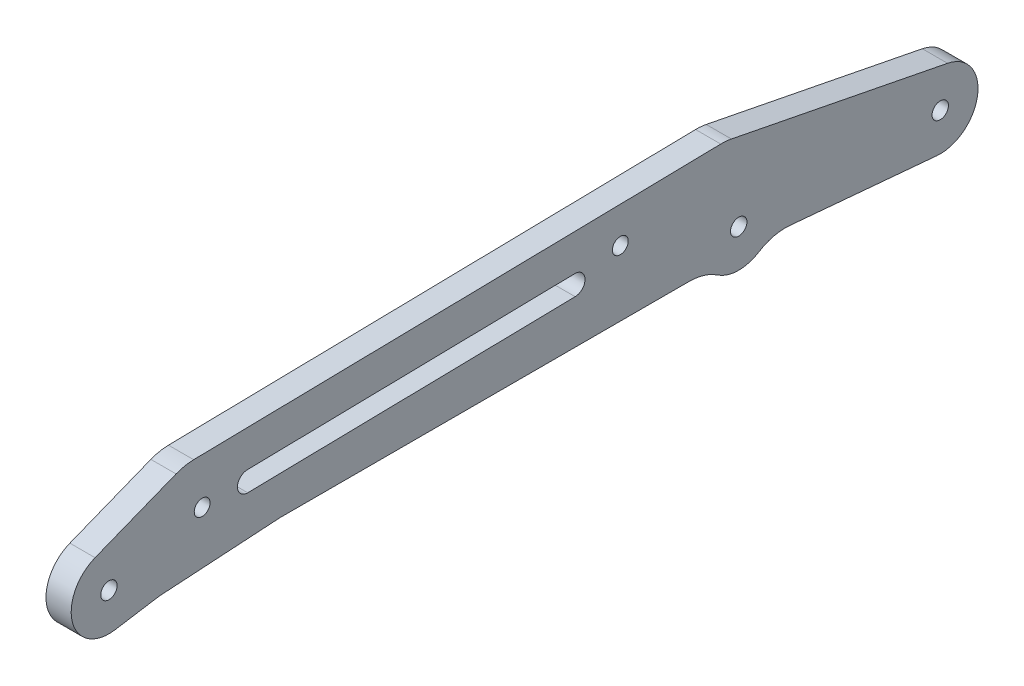
ISO-10303-21;
HEADER;
FILE_DESCRIPTION(('STEP AP214'),'2;1');
FILE_NAME('part.step','',(''),(''),'','','');
FILE_SCHEMA(('AUTOMOTIVE_DESIGN { 1 0 10303 214 1 1 1 1 }'));
ENDSEC;
DATA;
#1=APPLICATION_CONTEXT('core data for automotive mechanical design processes');
#2=APPLICATION_PROTOCOL_DEFINITION('international standard','automotive_design',2000,#1);
#3=PRODUCT_CONTEXT('',#1,'mechanical');
#4=PRODUCT('Part','Part','',(#3));
#5=PRODUCT_RELATED_PRODUCT_CATEGORY('part','',(#4));
#6=PRODUCT_DEFINITION_FORMATION('','',#4);
#7=PRODUCT_DEFINITION_CONTEXT('part definition',#1,'design');
#8=PRODUCT_DEFINITION('design','',#6,#7);
#9=PRODUCT_DEFINITION_SHAPE('','',#8);
#10=(LENGTH_UNIT() NAMED_UNIT(*) SI_UNIT(.MILLI.,.METRE.));
#11=(NAMED_UNIT(*) PLANE_ANGLE_UNIT() SI_UNIT($,.RADIAN.));
#12=(NAMED_UNIT(*) SI_UNIT($,.STERADIAN.) SOLID_ANGLE_UNIT());
#13=UNCERTAINTY_MEASURE_WITH_UNIT(LENGTH_MEASURE(1.E-05),#10,'distance_accuracy_value','');
#14=(GEOMETRIC_REPRESENTATION_CONTEXT(3) GLOBAL_UNCERTAINTY_ASSIGNED_CONTEXT((#13)) GLOBAL_UNIT_ASSIGNED_CONTEXT((#10,
#11,#12)) REPRESENTATION_CONTEXT('',''));
#15=CARTESIAN_POINT('',(0.,0.,0.));
#16=DIRECTION('',(0.,0.,1.));
#17=DIRECTION('',(1.,0.,0.));
#18=AXIS2_PLACEMENT_3D('',#15,#16,#17);
#19=CARTESIAN_POINT('',(2.5,-15.9506465412037,113.898149240446));
#20=DIRECTION('',(-1.,0.,0.));
#21=DIRECTION('',(0.,0.,1.));
#22=AXIS2_PLACEMENT_3D('',#19,#20,#21);
#23=CYLINDRICAL_SURFACE('',#22,9.99999999999999);
#24=DIRECTION('',(1.,0.,0.));
#25=VECTOR('',#24,1.);
#26=CARTESIAN_POINT('',(2.5,-6.07543657815531,115.473023262617));
#27=LINE('',#26,#25);
#28=CARTESIAN_POINT('',(-2.5,-6.0754365781553,115.473023262617));
#29=VERTEX_POINT('',#28);
#30=CARTESIAN_POINT('',(2.5,-6.07543657815531,115.473023262617));
#31=VERTEX_POINT('',#30);
#32=EDGE_CURVE('E167',#29,#31,#27,.T.);
#33=ORIENTED_EDGE('',*,*,#32,.F.);
#34=CARTESIAN_POINT('',(-2.5,-15.9506465412037,113.898149240446));
#35=DIRECTION('',(-1.,0.,0.));
#36=DIRECTION('',(0.,0.,1.));
#37=AXIS2_PLACEMENT_3D('',#34,#35,#36);
#38=CIRCLE('',#37,9.99999999999999);
#39=CARTESIAN_POINT('',(-2.5,-5.97012075637485,114.521932101997));
#40=VERTEX_POINT('',#39);
#41=EDGE_CURVE('E20',#40,#29,#38,.F.);
#42=ORIENTED_EDGE('',*,*,#41,.F.);
#43=DIRECTION('',(1.,0.,0.));
#44=VECTOR('',#43,1.);
#45=CARTESIAN_POINT('',(2.5,-5.97012075637486,114.521932101997));
#46=LINE('',#45,#44);
#47=CARTESIAN_POINT('',(2.5,-5.97012075637485,114.521932101997));
#48=VERTEX_POINT('',#47);
#49=EDGE_CURVE('E239',#40,#48,#46,.T.);
#50=ORIENTED_EDGE('',*,*,#49,.T.);
#51=CARTESIAN_POINT('',(2.5,-15.9506465412037,113.898149240446));
#52=DIRECTION('',(-1.,0.,0.));
#53=DIRECTION('',(0.,0.,1.));
#54=AXIS2_PLACEMENT_3D('',#51,#52,#53);
#55=CIRCLE('',#54,9.99999999999999);
#56=EDGE_CURVE('E168',#31,#48,#55,.T.);
#57=ORIENTED_EDGE('',*,*,#56,.F.);
#58=EDGE_LOOP('',(#33,#42,#50,#57));
#59=FACE_BOUND('',#58,.T.);
#60=ADVANCED_FACE('F17',(#59),#23,.F.);
#61=CARTESIAN_POINT('',(2.5,-14.5,90.687804581186));
#62=DIRECTION('',(1.,0.,0.));
#63=DIRECTION('',(0.,0.,-1.));
#64=AXIS2_PLACEMENT_3D('',#61,#62,#63);
#65=CYLINDRICAL_SURFACE('',#64,9.99999999999999);
#66=DIRECTION('',(1.,0.,0.));
#67=VECTOR('',#66,1.);
#68=CARTESIAN_POINT('',(2.5,-4.51947421517113,91.3115874427379));
#69=LINE('',#68,#67);
#70=CARTESIAN_POINT('',(2.5,-4.51947421517113,91.3115874427379));
#71=VERTEX_POINT('',#70);
#72=CARTESIAN_POINT('',(-2.5,-4.51947421517113,91.3115874427379));
#73=VERTEX_POINT('',#72);
#74=EDGE_CURVE('E238',#71,#73,#69,.F.);
#75=ORIENTED_EDGE('',*,*,#74,.T.);
#76=CARTESIAN_POINT('',(-2.5,-14.5,90.687804581186));
#77=DIRECTION('',(1.,0.,0.));
#78=DIRECTION('',(0.,0.,-1.));
#79=AXIS2_PLACEMENT_3D('',#76,#77,#78);
#80=CIRCLE('',#79,9.99999999999999);
#81=CARTESIAN_POINT('',(-2.5,-4.50000000000001,90.687804581186));
#82=VERTEX_POINT('',#81);
#83=EDGE_CURVE('E165',#82,#73,#80,.T.);
#84=ORIENTED_EDGE('',*,*,#83,.F.);
#85=DIRECTION('',(1.,0.,0.));
#86=VECTOR('',#85,1.);
#87=CARTESIAN_POINT('',(2.5,-4.50000000000001,90.687804581186));
#88=LINE('',#87,#86);
#89=CARTESIAN_POINT('',(2.5,-4.50000000000001,90.687804581186));
#90=VERTEX_POINT('',#89);
#91=EDGE_CURVE('E235',#82,#90,#88,.T.);
#92=ORIENTED_EDGE('',*,*,#91,.T.);
#93=CARTESIAN_POINT('',(2.5,-14.5,90.687804581186));
#94=DIRECTION('',(1.,0.,0.));
#95=DIRECTION('',(0.,0.,-1.));
#96=AXIS2_PLACEMENT_3D('',#93,#94,#95);
#97=CIRCLE('',#96,9.99999999999999);
#98=EDGE_CURVE('E323',#71,#90,#97,.F.);
#99=ORIENTED_EDGE('',*,*,#98,.F.);
#100=EDGE_LOOP('',(#75,#84,#92,#99));
#101=FACE_BOUND('',#100,.T.);
#102=ADVANCED_FACE('F331',(#101),#65,.F.);
#103=CARTESIAN_POINT('',(2.5,0.,0.));
#104=DIRECTION('',(1.,0.,0.));
#105=DIRECTION('',(0.,0.,-1.));
#106=AXIS2_PLACEMENT_3D('',#103,#104,#105);
#107=PLANE('',#106);
#108=CARTESIAN_POINT('',(2.5,0.,125.));
#109=DIRECTION('',(-1.,0.,0.));
#110=DIRECTION('',(0.,0.,1.));
#111=AXIS2_PLACEMENT_3D('',#108,#109,#110);
#112=CIRCLE('',#111,1.62500000000002);
#113=CARTESIAN_POINT('',(2.5,0.,126.625));
#114=VERTEX_POINT('',#113);
#115=EDGE_CURVE('E299',#114,#114,#112,.T.);
#116=ORIENTED_EDGE('',*,*,#115,.T.);
#117=EDGE_LOOP('',(#116));
#118=FACE_BOUND('',#117,.T.);
#119=CARTESIAN_POINT('',(2.5,0.,0.));
#120=DIRECTION('',(-1.,0.,0.));
#121=DIRECTION('',(0.,0.,1.));
#122=AXIS2_PLACEMENT_3D('',#119,#120,#121);
#123=CIRCLE('',#122,1.625);
#124=CARTESIAN_POINT('',(2.5,0.,1.625));
#125=VERTEX_POINT('',#124);
#126=EDGE_CURVE('E192',#125,#125,#123,.T.);
#127=ORIENTED_EDGE('',*,*,#126,.T.);
#128=EDGE_LOOP('',(#127));
#129=FACE_BOUND('',#128,.T.);
#130=CARTESIAN_POINT('',(2.5,4.98106203042247,97.4943767977606));
#131=DIRECTION('',(-1.,0.,0.));
#132=DIRECTION('',(0.,0.,1.));
#133=AXIS2_PLACEMENT_3D('',#130,#131,#132);
#134=CIRCLE('',#133,2.);
#135=CARTESIAN_POINT('',(2.5,2.98140807363721,97.4571739334483));
#136=VERTEX_POINT('',#135);
#137=CARTESIAN_POINT('',(2.5,6.98071598720774,97.5315796620728));
#138=VERTEX_POINT('',#137);
#139=EDGE_CURVE('E199',#136,#138,#134,.T.);
#140=ORIENTED_EDGE('',*,*,#139,.T.);
#141=DIRECTION('',(0.,-0.0186014321561424,0.999826978392632));
#142=VECTOR('',#141,1.);
#143=CARTESIAN_POINT('',(2.5,8.79221372846742,0.163576069366839));
#144=LINE('',#143,#142);
#145=CARTESIAN_POINT('',(2.5,8.18980907735699,32.5428260665517));
#146=VERTEX_POINT('',#145);
#147=EDGE_CURVE('E195',#138,#146,#144,.F.);
#148=ORIENTED_EDGE('',*,*,#147,.T.);
#149=CARTESIAN_POINT('',(2.5,6.19015512057173,32.5056232022395));
#150=DIRECTION('',(-1.,0.,0.));
#151=DIRECTION('',(0.,0.,1.));
#152=AXIS2_PLACEMENT_3D('',#149,#150,#151);
#153=CIRCLE('',#152,2.);
#154=CARTESIAN_POINT('',(2.5,4.19050116378646,32.4684203379272));
#155=VERTEX_POINT('',#154);
#156=EDGE_CURVE('E193',#146,#155,#153,.T.);
#157=ORIENTED_EDGE('',*,*,#156,.T.);
#158=DIRECTION('',(0.,-0.0186014321561424,0.999826978392632));
#159=VECTOR('',#158,1.);
#160=CARTESIAN_POINT('',(2.5,4.79290581489689,0.0891703407422695));
#161=LINE('',#160,#159);
#162=EDGE_CURVE('E203',#136,#155,#161,.F.);
#163=ORIENTED_EDGE('',*,*,#162,.F.);
#164=EDGE_LOOP('',(#140,#148,#157,#163));
#165=FACE_BOUND('',#164,.T.);
#166=CARTESIAN_POINT('',(2.5,4.99999999999999,106.5));
#167=DIRECTION('',(-1.,0.,0.));
#168=DIRECTION('',(0.,0.,1.));
#169=AXIS2_PLACEMENT_3D('',#166,#167,#168);
#170=CIRCLE('',#169,1.57499999999999);
#171=CARTESIAN_POINT('',(2.5,4.99999999999999,108.075));
#172=VERTEX_POINT('',#171);
#173=EDGE_CURVE('E251',#172,#172,#170,.T.);
#174=ORIENTED_EDGE('',*,*,#173,.T.);
#175=EDGE_LOOP('',(#174));
#176=FACE_BOUND('',#175,.T.);
#177=CARTESIAN_POINT('',(2.5,8.5,23.5));
#178=DIRECTION('',(-1.,0.,0.));
#179=DIRECTION('',(0.,0.,1.));
#180=AXIS2_PLACEMENT_3D('',#177,#178,#179);
#181=CIRCLE('',#180,1.575);
#182=CARTESIAN_POINT('',(2.5,8.5,25.075));
#183=VERTEX_POINT('',#182);
#184=EDGE_CURVE('E210',#183,#183,#181,.T.);
#185=ORIENTED_EDGE('',*,*,#184,.T.);
#186=EDGE_LOOP('',(#185));
#187=FACE_BOUND('',#186,.T.);
#188=DIRECTION('',(0.,-0.0887576580011616,-0.99605325065789));
#189=VECTOR('',#188,1.);
#190=CARTESIAN_POINT('',(2.5,-3.93410522902064,0.350565560854665));
#191=LINE('',#190,#189);
#192=CARTESIAN_POINT('',(2.5,-7.47039937993417,-39.3343175649913));
#193=VERTEX_POINT('',#192);
#194=CARTESIAN_POINT('',(2.5,-4.87198454255356,-10.174472616212));
#195=VERTEX_POINT('',#194);
#196=EDGE_CURVE('E222',#193,#195,#191,.F.);
#197=ORIENTED_EDGE('',*,*,#196,.F.);
#198=CARTESIAN_POINT('',(2.5,0.,-40.));
#199=DIRECTION('',(-1.,0.,0.));
#200=DIRECTION('',(0.,0.,1.));
#201=AXIS2_PLACEMENT_3D('',#198,#199,#200);
#202=CIRCLE('',#201,7.5);
#203=CARTESIAN_POINT('',(2.5,7.35909794826338,-41.4469545216992));
#204=VERTEX_POINT('',#203);
#205=EDGE_CURVE('E219',#204,#193,#202,.T.);
#206=ORIENTED_EDGE('',*,*,#205,.F.);
#207=DIRECTION('',(0.,0.192927269559888,0.981213059768451));
#208=VECTOR('',#207,1.);
#209=CARTESIAN_POINT('',(2.5,14.9312082073686,-2.9357917752925));
#210=LINE('',#209,#208);
#211=CARTESIAN_POINT('',(2.5,15.7939988386428,1.45229414528999));
#212=VERTEX_POINT('',#211);
#213=EDGE_CURVE('E216',#212,#204,#210,.F.);
#214=ORIENTED_EDGE('',*,*,#213,.F.);
#215=CARTESIAN_POINT('',(2.5,5.98186824095833,3.38156684088887));
#216=DIRECTION('',(-1.,0.,0.));
#217=DIRECTION('',(0.,0.,1.));
#218=AXIS2_PLACEMENT_3D('',#215,#216,#217);
#219=CIRCLE('',#218,10.);
#220=CARTESIAN_POINT('',(2.5,15.9801380248846,3.56758116245029));
#221=VERTEX_POINT('',#220);
#222=EDGE_CURVE('E213',#221,#212,#219,.T.);
#223=ORIENTED_EDGE('',*,*,#222,.F.);
#224=DIRECTION('',(0.,-0.0186014321561421,0.999826978392632));
#225=VECTOR('',#224,1.);
#226=CARTESIAN_POINT('',(2.5,16.040959321814,0.298436452498867));
#227=LINE('',#226,#225);
#228=CARTESIAN_POINT('',(2.5,14.0336689941836,108.190291562629));
#229=VERTEX_POINT('',#228);
#230=EDGE_CURVE('E207',#229,#221,#227,.F.);
#231=ORIENTED_EDGE('',*,*,#230,.F.);
#232=CARTESIAN_POINT('',(2.5,4.03539921025731,108.004277241067));
#233=DIRECTION('',(-1.,0.,0.));
#234=DIRECTION('',(0.,0.,1.));
#235=AXIS2_PLACEMENT_3D('',#232,#233,#234);
#236=CIRCLE('',#235,9.99999999999999);
#237=CARTESIAN_POINT('',(2.5,13.3341269732446,111.683089819856));
#238=VERTEX_POINT('',#237);
#239=EDGE_CURVE('E260',#238,#229,#236,.T.);
#240=ORIENTED_EDGE('',*,*,#239,.F.);
#241=DIRECTION('',(0.,-0.367881257878812,0.929872776298727));
#242=VECTOR('',#241,1.);
#243=CARTESIAN_POINT('',(2.5,49.7343916487453,19.6761869214032));
#244=LINE('',#243,#242);
#245=CARTESIAN_POINT('',(2.5,6.97404582224044,127.759109434091));
#246=VERTEX_POINT('',#245);
#247=EDGE_CURVE('E249',#246,#238,#244,.F.);
#248=ORIENTED_EDGE('',*,*,#247,.F.);
#249=CARTESIAN_POINT('',(2.5,0.,125.));
#250=DIRECTION('',(-1.,0.,0.));
#251=DIRECTION('',(0.,0.,1.));
#252=AXIS2_PLACEMENT_3D('',#249,#250,#251);
#253=CIRCLE('',#252,7.50000000000001);
#254=CARTESIAN_POINT('',(2.5,-7.40640747228635,123.818844483372));
#255=VERTEX_POINT('',#254);
#256=EDGE_CURVE('E172',#255,#246,#253,.T.);
#257=ORIENTED_EDGE('',*,*,#256,.F.);
#258=DIRECTION('',(0.,0.157487402217094,-0.987520996304844));
#259=VECTOR('',#258,1.);
#260=CARTESIAN_POINT('',(2.5,12.0338570705745,1.91912971550789));
#261=LINE('',#260,#259);
#262=EDGE_CURVE('E171',#31,#255,#261,.F.);
#263=ORIENTED_EDGE('',*,*,#262,.F.);
#264=ORIENTED_EDGE('',*,*,#56,.T.);
#265=DIRECTION('',(0.,-0.0623782861551807,0.998052578482889));
#266=VECTOR('',#265,1.);
#267=CARTESIAN_POINT('',(2.5,1.18287937743191,0.0739299610894947));
#268=LINE('',#267,#266);
#269=EDGE_CURVE('E241',#48,#71,#268,.F.);
#270=ORIENTED_EDGE('',*,*,#269,.T.);
#271=ORIENTED_EDGE('',*,*,#98,.T.);
#272=DIRECTION('',(0.,0.,1.));
#273=VECTOR('',#272,1.);
#274=CARTESIAN_POINT('',(2.5,-4.50000000000001,0.));
#275=LINE('',#274,#273);
#276=CARTESIAN_POINT('',(2.5,-4.50000000000001,9.7979589711327));
#277=VERTEX_POINT('',#276);
#278=EDGE_CURVE('E234',#90,#277,#275,.F.);
#279=ORIENTED_EDGE('',*,*,#278,.T.);
#280=CARTESIAN_POINT('',(2.5,-14.5,9.7979589711327));
#281=DIRECTION('',(-1.,0.,0.));
#282=DIRECTION('',(0.,0.,1.));
#283=AXIS2_PLACEMENT_3D('',#280,#281,#282);
#284=CIRCLE('',#283,10.);
#285=CARTESIAN_POINT('',(2.5,-6.21428571428572,4.19912527334258));
#286=VERTEX_POINT('',#285);
#287=EDGE_CURVE('E233',#277,#286,#284,.T.);
#288=ORIENTED_EDGE('',*,*,#287,.T.);
#289=CARTESIAN_POINT('',(2.5,0.,0.));
#290=DIRECTION('',(-1.,0.,0.));
#291=DIRECTION('',(0.,0.,1.));
#292=AXIS2_PLACEMENT_3D('',#289,#290,#291);
#293=CIRCLE('',#292,7.5);
#294=CARTESIAN_POINT('',(2.5,-6.35679302105677,-3.98009830122875));
#295=VERTEX_POINT('',#294);
#296=EDGE_CURVE('E229',#295,#286,#293,.T.);
#297=ORIENTED_EDGE('',*,*,#296,.F.);
#298=CARTESIAN_POINT('',(2.5,-14.8325170491325,-9.28689603620041));
#299=DIRECTION('',(-1.,0.,0.));
#300=DIRECTION('',(0.,0.,1.));
#301=AXIS2_PLACEMENT_3D('',#298,#299,#300);
#302=CIRCLE('',#301,10.);
#303=EDGE_CURVE('E226',#295,#195,#302,.T.);
#304=ORIENTED_EDGE('',*,*,#303,.T.);
#305=EDGE_LOOP('',(#197,#206,#214,#223,#231,#240,#248,#257,#263,#264,#270,#271,#279,#288,#297,#304));
#306=FACE_BOUND('',#305,.T.);
#307=CARTESIAN_POINT('',(2.5,0.,-40.));
#308=DIRECTION('',(-1.,0.,0.));
#309=DIRECTION('',(0.,0.,1.));
#310=AXIS2_PLACEMENT_3D('',#307,#308,#309);
#311=CIRCLE('',#310,1.625);
#312=CARTESIAN_POINT('',(2.5,0.,-38.375));
#313=VERTEX_POINT('',#312);
#314=EDGE_CURVE('E320',#313,#313,#311,.T.);
#315=ORIENTED_EDGE('',*,*,#314,.T.);
#316=EDGE_LOOP('',(#315));
#317=FACE_BOUND('',#316,.T.);
#318=ADVANCED_FACE('F337',(#118,#129,#165,#176,#187,#306,#317),#107,.T.);
#319=CARTESIAN_POINT('',(2.5,0.,-40.));
#320=DIRECTION('',(-1.,0.,0.));
#321=DIRECTION('',(0.,0.,1.));
#322=AXIS2_PLACEMENT_3D('',#319,#320,#321);
#323=CYLINDRICAL_SURFACE('',#322,1.625);
#324=CARTESIAN_POINT('',(-2.5,0.,-40.));
#325=DIRECTION('',(-1.,0.,0.));
#326=DIRECTION('',(0.,0.,1.));
#327=AXIS2_PLACEMENT_3D('',#324,#325,#326);
#328=CIRCLE('',#327,1.625);
#329=CARTESIAN_POINT('',(-2.5,0.,-38.375));
#330=VERTEX_POINT('',#329);
#331=EDGE_CURVE('E296',#330,#330,#328,.T.);
#332=ORIENTED_EDGE('',*,*,#331,.T.);
#333=EDGE_LOOP('',(#332));
#334=FACE_BOUND('',#333,.T.);
#335=ORIENTED_EDGE('',*,*,#314,.F.);
#336=EDGE_LOOP('',(#335));
#337=FACE_BOUND('',#336,.T.);
#338=ADVANCED_FACE('F594',(#334,#337),#323,.F.);
#339=CARTESIAN_POINT('',(2.5,4.03539921025731,108.004277241067));
#340=DIRECTION('',(-1.,0.,0.));
#341=DIRECTION('',(0.,0.,1.));
#342=AXIS2_PLACEMENT_3D('',#339,#340,#341);
#343=CYLINDRICAL_SURFACE('',#342,9.99999999999999);
#344=CARTESIAN_POINT('',(-2.5,4.03539921025731,108.004277241067));
#345=DIRECTION('',(-1.,0.,0.));
#346=DIRECTION('',(0.,0.,1.));
#347=AXIS2_PLACEMENT_3D('',#344,#345,#346);
#348=CIRCLE('',#347,9.99999999999999);
#349=CARTESIAN_POINT('',(-2.5,14.0336689941836,108.190291562629));
#350=VERTEX_POINT('',#349);
#351=CARTESIAN_POINT('',(-2.5,13.3341269732446,111.683089819856));
#352=VERTEX_POINT('',#351);
#353=EDGE_CURVE('E188',#350,#352,#348,.F.);
#354=ORIENTED_EDGE('',*,*,#353,.T.);
#355=DIRECTION('',(1.,0.,0.));
#356=VECTOR('',#355,1.);
#357=CARTESIAN_POINT('',(2.5,13.3341269732446,111.683089819856));
#358=LINE('',#357,#356);
#359=EDGE_CURVE('E247',#238,#352,#358,.F.);
#360=ORIENTED_EDGE('',*,*,#359,.F.);
#361=ORIENTED_EDGE('',*,*,#239,.T.);
#362=DIRECTION('',(1.,0.,0.));
#363=VECTOR('',#362,1.);
#364=CARTESIAN_POINT('',(2.5,14.0336689941836,108.190291562629));
#365=LINE('',#364,#363);
#366=EDGE_CURVE('E206',#350,#229,#365,.T.);
#367=ORIENTED_EDGE('',*,*,#366,.F.);
#368=EDGE_LOOP('',(#354,#360,#361,#367));
#369=FACE_BOUND('',#368,.T.);
#370=ADVANCED_FACE('F351',(#369),#343,.T.);
#371=CARTESIAN_POINT('',(2.5,49.7343916487453,19.6761869214032));
#372=DIRECTION('',(0.,0.929872776298727,0.367881257878812));
#373=DIRECTION('',(0.,-0.367881257878812,0.929872776298727));
#374=AXIS2_PLACEMENT_3D('',#371,#372,#373);
#375=PLANE('',#374);
#376=DIRECTION('',(0.,-0.367881257878812,0.929872776298727));
#377=VECTOR('',#376,1.);
#378=CARTESIAN_POINT('',(-2.5,13.3341269732446,111.683089819856));
#379=LINE('',#378,#377);
#380=CARTESIAN_POINT('',(-2.5,6.97404582224044,127.759109434091));
#381=VERTEX_POINT('',#380);
#382=EDGE_CURVE('E182',#352,#381,#379,.T.);
#383=ORIENTED_EDGE('',*,*,#382,.T.);
#384=DIRECTION('',(-1.,0.,0.));
#385=VECTOR('',#384,1.);
#386=CARTESIAN_POINT('',(2.5,6.97404582224044,127.759109434091));
#387=LINE('',#386,#385);
#388=EDGE_CURVE('E245',#246,#381,#387,.T.);
#389=ORIENTED_EDGE('',*,*,#388,.F.);
#390=ORIENTED_EDGE('',*,*,#247,.T.);
#391=ORIENTED_EDGE('',*,*,#359,.T.);
#392=EDGE_LOOP('',(#383,#389,#390,#391));
#393=FACE_BOUND('',#392,.T.);
#394=ADVANCED_FACE('F348',(#393),#375,.T.);
#395=CARTESIAN_POINT('',(2.5,0.,125.));
#396=DIRECTION('',(-1.,0.,0.));
#397=DIRECTION('',(0.,0.,1.));
#398=AXIS2_PLACEMENT_3D('',#395,#396,#397);
#399=CYLINDRICAL_SURFACE('',#398,7.50000000000001);
#400=CARTESIAN_POINT('',(-2.5,0.,125.));
#401=DIRECTION('',(-1.,0.,0.));
#402=DIRECTION('',(0.,0.,1.));
#403=AXIS2_PLACEMENT_3D('',#400,#401,#402);
#404=CIRCLE('',#403,7.50000000000001);
#405=CARTESIAN_POINT('',(-2.5,-7.40640747228635,123.818844483372));
#406=VERTEX_POINT('',#405);
#407=EDGE_CURVE('E178',#381,#406,#404,.F.);
#408=ORIENTED_EDGE('',*,*,#407,.T.);
#409=DIRECTION('',(1.,0.,0.));
#410=VECTOR('',#409,1.);
#411=CARTESIAN_POINT('',(2.5,-7.40640747228636,123.818844483372));
#412=LINE('',#411,#410);
#413=EDGE_CURVE('E177',#255,#406,#412,.F.);
#414=ORIENTED_EDGE('',*,*,#413,.F.);
#415=ORIENTED_EDGE('',*,*,#256,.T.);
#416=ORIENTED_EDGE('',*,*,#388,.T.);
#417=EDGE_LOOP('',(#408,#414,#415,#416));
#418=FACE_BOUND('',#417,.T.);
#419=ADVANCED_FACE('F345',(#418),#399,.T.);
#420=CARTESIAN_POINT('',(2.5,12.0338570705745,1.91912971550789));
#421=DIRECTION('',(0.,-0.987520996304844,-0.157487402217094));
#422=DIRECTION('',(0.,0.157487402217094,-0.987520996304844));
#423=AXIS2_PLACEMENT_3D('',#420,#421,#422);
#424=PLANE('',#423);
#425=ORIENTED_EDGE('',*,*,#262,.T.);
#426=ORIENTED_EDGE('',*,*,#413,.T.);
#427=DIRECTION('',(0.,0.157487402217095,-0.987520996304844));
#428=VECTOR('',#427,1.);
#429=CARTESIAN_POINT('',(-2.5,-7.40640747228635,123.818844483372));
#430=LINE('',#429,#428);
#431=EDGE_CURVE('E162',#406,#29,#430,.T.);
#432=ORIENTED_EDGE('',*,*,#431,.T.);
#433=ORIENTED_EDGE('',*,*,#32,.T.);
#434=EDGE_LOOP('',(#425,#426,#432,#433));
#435=FACE_BOUND('',#434,.T.);
#436=ADVANCED_FACE('F175',(#435),#424,.T.);
#437=CARTESIAN_POINT('',(2.5,1.18287937743191,0.0739299610894947));
#438=DIRECTION('',(0.,0.998052578482889,0.0623782861551807));
#439=DIRECTION('',(0.,-0.0623782861551807,0.998052578482889));
#440=AXIS2_PLACEMENT_3D('',#437,#438,#439);
#441=PLANE('',#440);
#442=ORIENTED_EDGE('',*,*,#74,.F.);
#443=ORIENTED_EDGE('',*,*,#269,.F.);
#444=ORIENTED_EDGE('',*,*,#49,.F.);
#445=DIRECTION('',(0.,0.0623782861551807,-0.998052578482889));
#446=VECTOR('',#445,1.);
#447=CARTESIAN_POINT('',(-2.5,-5.97012075637486,114.521932101997));
#448=LINE('',#447,#446);
#449=EDGE_CURVE('E164',#40,#73,#448,.T.);
#450=ORIENTED_EDGE('',*,*,#449,.T.);
#451=EDGE_LOOP('',(#442,#443,#444,#450));
#452=FACE_BOUND('',#451,.T.);
#453=ADVANCED_FACE('F334',(#452),#441,.F.);
#454=CARTESIAN_POINT('',(2.5,-4.50000000000001,0.));
#455=DIRECTION('',(0.,1.,0.));
#456=DIRECTION('',(0.,0.,1.));
#457=AXIS2_PLACEMENT_3D('',#454,#455,#456);
#458=PLANE('',#457);
#459=ORIENTED_EDGE('',*,*,#91,.F.);
#460=DIRECTION('',(0.,0.,-1.));
#461=VECTOR('',#460,1.);
#462=CARTESIAN_POINT('',(-2.5,-4.50000000000001,0.));
#463=LINE('',#462,#461);
#464=CARTESIAN_POINT('',(-2.5,-4.50000000000001,9.7979589711327));
#465=VERTEX_POINT('',#464);
#466=EDGE_CURVE('E180',#82,#465,#463,.T.);
#467=ORIENTED_EDGE('',*,*,#466,.T.);
#468=DIRECTION('',(-1.,0.,0.));
#469=VECTOR('',#468,1.);
#470=CARTESIAN_POINT('',(2.5,-4.50000000000001,9.7979589711327));
#471=LINE('',#470,#469);
#472=EDGE_CURVE('E230',#465,#277,#471,.F.);
#473=ORIENTED_EDGE('',*,*,#472,.T.);
#474=ORIENTED_EDGE('',*,*,#278,.F.);
#475=EDGE_LOOP('',(#459,#467,#473,#474));
#476=FACE_BOUND('',#475,.T.);
#477=ADVANCED_FACE('F375',(#476),#458,.F.);
#478=CARTESIAN_POINT('',(2.5,-14.5,9.7979589711327));
#479=DIRECTION('',(-1.,0.,0.));
#480=DIRECTION('',(0.,0.,1.));
#481=AXIS2_PLACEMENT_3D('',#478,#479,#480);
#482=CYLINDRICAL_SURFACE('',#481,10.);
#483=ORIENTED_EDGE('',*,*,#472,.F.);
#484=CARTESIAN_POINT('',(-2.5,-14.5,9.7979589711327));
#485=DIRECTION('',(-1.,0.,0.));
#486=DIRECTION('',(0.,0.,1.));
#487=AXIS2_PLACEMENT_3D('',#484,#485,#486);
#488=CIRCLE('',#487,10.);
#489=CARTESIAN_POINT('',(-2.5,-6.21428571428572,4.19912527334258));
#490=VERTEX_POINT('',#489);
#491=EDGE_CURVE('E291',#465,#490,#488,.T.);
#492=ORIENTED_EDGE('',*,*,#491,.T.);
#493=DIRECTION('',(-1.,0.,0.));
#494=VECTOR('',#493,1.);
#495=CARTESIAN_POINT('',(2.5,-6.21428571428572,4.19912527334258));
#496=LINE('',#495,#494);
#497=EDGE_CURVE('E227',#286,#490,#496,.T.);
#498=ORIENTED_EDGE('',*,*,#497,.F.);
#499=ORIENTED_EDGE('',*,*,#287,.F.);
#500=EDGE_LOOP('',(#483,#492,#498,#499));
#501=FACE_BOUND('',#500,.T.);
#502=ADVANCED_FACE('F379',(#501),#482,.F.);
#503=CARTESIAN_POINT('',(2.5,0.,0.));
#504=DIRECTION('',(-1.,0.,0.));
#505=DIRECTION('',(0.,0.,1.));
#506=AXIS2_PLACEMENT_3D('',#503,#504,#505);
#507=CYLINDRICAL_SURFACE('',#506,7.5);
#508=ORIENTED_EDGE('',*,*,#296,.T.);
#509=ORIENTED_EDGE('',*,*,#497,.T.);
#510=CARTESIAN_POINT('',(-2.5,0.,0.));
#511=DIRECTION('',(-1.,0.,0.));
#512=DIRECTION('',(0.,0.,1.));
#513=AXIS2_PLACEMENT_3D('',#510,#511,#512);
#514=CIRCLE('',#513,7.5);
#515=CARTESIAN_POINT('',(-2.5,-6.35679302105677,-3.98009830122875));
#516=VERTEX_POINT('',#515);
#517=EDGE_CURVE('E288',#490,#516,#514,.F.);
#518=ORIENTED_EDGE('',*,*,#517,.T.);
#519=DIRECTION('',(-1.,0.,0.));
#520=VECTOR('',#519,1.);
#521=CARTESIAN_POINT('',(2.5,-6.35679302105677,-3.98009830122875));
#522=LINE('',#521,#520);
#523=EDGE_CURVE('E223',#516,#295,#522,.F.);
#524=ORIENTED_EDGE('',*,*,#523,.T.);
#525=EDGE_LOOP('',(#508,#509,#518,#524));
#526=FACE_BOUND('',#525,.T.);
#527=ADVANCED_FACE('F382',(#526),#507,.T.);
#528=CARTESIAN_POINT('',(2.5,-14.8325170491325,-9.28689603620041));
#529=DIRECTION('',(-1.,0.,0.));
#530=DIRECTION('',(0.,0.,1.));
#531=AXIS2_PLACEMENT_3D('',#528,#529,#530);
#532=CYLINDRICAL_SURFACE('',#531,10.);
#533=ORIENTED_EDGE('',*,*,#523,.F.);
#534=CARTESIAN_POINT('',(-2.5,-14.8325170491325,-9.28689603620041));
#535=DIRECTION('',(-1.,0.,0.));
#536=DIRECTION('',(0.,0.,1.));
#537=AXIS2_PLACEMENT_3D('',#534,#535,#536);
#538=CIRCLE('',#537,10.);
#539=CARTESIAN_POINT('',(-2.5,-4.87198454255356,-10.174472616212));
#540=VERTEX_POINT('',#539);
#541=EDGE_CURVE('E285',#516,#540,#538,.T.);
#542=ORIENTED_EDGE('',*,*,#541,.T.);
#543=DIRECTION('',(1.,0.,0.));
#544=VECTOR('',#543,1.);
#545=CARTESIAN_POINT('',(2.5,-4.87198454255356,-10.174472616212));
#546=LINE('',#545,#544);
#547=EDGE_CURVE('E220',#195,#540,#546,.F.);
#548=ORIENTED_EDGE('',*,*,#547,.F.);
#549=ORIENTED_EDGE('',*,*,#303,.F.);
#550=EDGE_LOOP('',(#533,#542,#548,#549));
#551=FACE_BOUND('',#550,.T.);
#552=ADVANCED_FACE('F387',(#551),#532,.F.);
#553=CARTESIAN_POINT('',(2.5,-3.93410522902064,0.350565560854665));
#554=DIRECTION('',(0.,-0.99605325065789,0.0887576580011616));
#555=DIRECTION('',(0.,-0.0887576580011616,-0.99605325065789));
#556=AXIS2_PLACEMENT_3D('',#553,#554,#555);
#557=PLANE('',#556);
#558=DIRECTION('',(0.,-0.0887576580011616,-0.99605325065789));
#559=VECTOR('',#558,1.);
#560=CARTESIAN_POINT('',(-2.5,-4.87198454255356,-10.174472616212));
#561=LINE('',#560,#559);
#562=CARTESIAN_POINT('',(-2.5,-7.47039937993417,-39.3343175649913));
#563=VERTEX_POINT('',#562);
#564=EDGE_CURVE('E284',#540,#563,#561,.T.);
#565=ORIENTED_EDGE('',*,*,#564,.T.);
#566=DIRECTION('',(-1.,0.,0.));
#567=VECTOR('',#566,1.);
#568=CARTESIAN_POINT('',(2.5,-7.47039937993417,-39.3343175649913));
#569=LINE('',#568,#567);
#570=EDGE_CURVE('E217',#193,#563,#569,.T.);
#571=ORIENTED_EDGE('',*,*,#570,.F.);
#572=ORIENTED_EDGE('',*,*,#196,.T.);
#573=ORIENTED_EDGE('',*,*,#547,.T.);
#574=EDGE_LOOP('',(#565,#571,#572,#573));
#575=FACE_BOUND('',#574,.T.);
#576=ADVANCED_FACE('F391',(#575),#557,.T.);
#577=CARTESIAN_POINT('',(2.5,0.,-40.));
#578=DIRECTION('',(-1.,0.,0.));
#579=DIRECTION('',(0.,0.,1.));
#580=AXIS2_PLACEMENT_3D('',#577,#578,#579);
#581=CYLINDRICAL_SURFACE('',#580,7.5);
#582=ORIENTED_EDGE('',*,*,#205,.T.);
#583=ORIENTED_EDGE('',*,*,#570,.T.);
#584=CARTESIAN_POINT('',(-2.5,0.,-40.));
#585=DIRECTION('',(-1.,0.,0.));
#586=DIRECTION('',(0.,0.,1.));
#587=AXIS2_PLACEMENT_3D('',#584,#585,#586);
#588=CIRCLE('',#587,7.5);
#589=CARTESIAN_POINT('',(-2.5,7.35909794826338,-41.4469545216992));
#590=VERTEX_POINT('',#589);
#591=EDGE_CURVE('E281',#563,#590,#588,.F.);
#592=ORIENTED_EDGE('',*,*,#591,.T.);
#593=DIRECTION('',(1.,0.,0.));
#594=VECTOR('',#593,1.);
#595=CARTESIAN_POINT('',(2.5,7.35909794826338,-41.4469545216992));
#596=LINE('',#595,#594);
#597=EDGE_CURVE('E214',#204,#590,#596,.F.);
#598=ORIENTED_EDGE('',*,*,#597,.F.);
#599=EDGE_LOOP('',(#582,#583,#592,#598));
#600=FACE_BOUND('',#599,.T.);
#601=ADVANCED_FACE('F393',(#600),#581,.T.);
#602=CARTESIAN_POINT('',(2.5,14.9312082073686,-2.9357917752925));
#603=DIRECTION('',(0.,0.981213059768451,-0.192927269559888));
#604=DIRECTION('',(0.,0.192927269559888,0.981213059768451));
#605=AXIS2_PLACEMENT_3D('',#602,#603,#604);
#606=PLANE('',#605);
#607=ORIENTED_EDGE('',*,*,#213,.T.);
#608=ORIENTED_EDGE('',*,*,#597,.T.);
#609=DIRECTION('',(0.,0.192927269559888,0.981213059768452));
#610=VECTOR('',#609,1.);
#611=CARTESIAN_POINT('',(-2.5,7.35909794826338,-41.4469545216992));
#612=LINE('',#611,#610);
#613=CARTESIAN_POINT('',(-2.5,15.7939988386428,1.45229414529));
#614=VERTEX_POINT('',#613);
#615=EDGE_CURVE('E280',#590,#614,#612,.T.);
#616=ORIENTED_EDGE('',*,*,#615,.T.);
#617=DIRECTION('',(-1.,0.,0.));
#618=VECTOR('',#617,1.);
#619=CARTESIAN_POINT('',(2.5,15.7939988386428,1.45229414528999));
#620=LINE('',#619,#618);
#621=EDGE_CURVE('E211',#212,#614,#620,.T.);
#622=ORIENTED_EDGE('',*,*,#621,.F.);
#623=EDGE_LOOP('',(#607,#608,#616,#622));
#624=FACE_BOUND('',#623,.T.);
#625=ADVANCED_FACE('F366',(#624),#606,.T.);
#626=CARTESIAN_POINT('',(2.5,5.98186824095833,3.38156684088887));
#627=DIRECTION('',(-1.,0.,0.));
#628=DIRECTION('',(0.,0.,1.));
#629=AXIS2_PLACEMENT_3D('',#626,#627,#628);
#630=CYLINDRICAL_SURFACE('',#629,10.);
#631=CARTESIAN_POINT('',(-2.5,5.98186824095833,3.38156684088887));
#632=DIRECTION('',(-1.,0.,0.));
#633=DIRECTION('',(0.,0.,1.));
#634=AXIS2_PLACEMENT_3D('',#631,#632,#633);
#635=CIRCLE('',#634,10.);
#636=CARTESIAN_POINT('',(-2.5,15.9801380248846,3.56758116245029));
#637=VERTEX_POINT('',#636);
#638=EDGE_CURVE('E277',#614,#637,#635,.F.);
#639=ORIENTED_EDGE('',*,*,#638,.T.);
#640=DIRECTION('',(1.,0.,0.));
#641=VECTOR('',#640,1.);
#642=CARTESIAN_POINT('',(2.5,15.9801380248846,3.56758116245029));
#643=LINE('',#642,#641);
#644=EDGE_CURVE('E204',#221,#637,#643,.F.);
#645=ORIENTED_EDGE('',*,*,#644,.F.);
#646=ORIENTED_EDGE('',*,*,#222,.T.);
#647=ORIENTED_EDGE('',*,*,#621,.T.);
#648=EDGE_LOOP('',(#639,#645,#646,#647));
#649=FACE_BOUND('',#648,.T.);
#650=ADVANCED_FACE('F361',(#649),#630,.T.);
#651=CARTESIAN_POINT('',(2.5,16.040959321814,0.298436452498867));
#652=DIRECTION('',(0.,0.999826978392632,0.0186014321561421));
#653=DIRECTION('',(0.,-0.0186014321561421,0.999826978392632));
#654=AXIS2_PLACEMENT_3D('',#651,#652,#653);
#655=PLANE('',#654);
#656=DIRECTION('',(0.,-0.0186014321561421,0.999826978392632));
#657=VECTOR('',#656,1.);
#658=CARTESIAN_POINT('',(-2.5,15.9801380248846,3.56758116245029));
#659=LINE('',#658,#657);
#660=EDGE_CURVE('E276',#637,#350,#659,.T.);
#661=ORIENTED_EDGE('',*,*,#660,.T.);
#662=ORIENTED_EDGE('',*,*,#366,.T.);
#663=ORIENTED_EDGE('',*,*,#230,.T.);
#664=ORIENTED_EDGE('',*,*,#644,.T.);
#665=EDGE_LOOP('',(#661,#662,#663,#664));
#666=FACE_BOUND('',#665,.T.);
#667=ADVANCED_FACE('F441',(#666),#655,.T.);
#668=CARTESIAN_POINT('',(2.5,8.5,23.5));
#669=DIRECTION('',(-1.,0.,0.));
#670=DIRECTION('',(0.,0.,1.));
#671=AXIS2_PLACEMENT_3D('',#668,#669,#670);
#672=CYLINDRICAL_SURFACE('',#671,1.575);
#673=CARTESIAN_POINT('',(-2.5,8.5,23.5));
#674=DIRECTION('',(-1.,0.,0.));
#675=DIRECTION('',(0.,0.,1.));
#676=AXIS2_PLACEMENT_3D('',#673,#674,#675);
#677=CIRCLE('',#676,1.575);
#678=CARTESIAN_POINT('',(-2.5,8.5,25.075));
#679=VERTEX_POINT('',#678);
#680=EDGE_CURVE('E273',#679,#679,#677,.T.);
#681=ORIENTED_EDGE('',*,*,#680,.T.);
#682=EDGE_LOOP('',(#681));
#683=FACE_BOUND('',#682,.T.);
#684=ORIENTED_EDGE('',*,*,#184,.F.);
#685=EDGE_LOOP('',(#684));
#686=FACE_BOUND('',#685,.T.);
#687=ADVANCED_FACE('F437',(#683,#686),#672,.F.);
#688=CARTESIAN_POINT('',(2.5,4.99999999999999,106.5));
#689=DIRECTION('',(-1.,0.,0.));
#690=DIRECTION('',(0.,0.,1.));
#691=AXIS2_PLACEMENT_3D('',#688,#689,#690);
#692=CYLINDRICAL_SURFACE('',#691,1.57499999999999);
#693=CARTESIAN_POINT('',(-2.5,4.99999999999999,106.5));
#694=DIRECTION('',(-1.,0.,0.));
#695=DIRECTION('',(0.,0.,1.));
#696=AXIS2_PLACEMENT_3D('',#693,#694,#695);
#697=CIRCLE('',#696,1.57499999999999);
#698=CARTESIAN_POINT('',(-2.5,4.99999999999999,108.075));
#699=VERTEX_POINT('',#698);
#700=EDGE_CURVE('E270',#699,#699,#697,.T.);
#701=ORIENTED_EDGE('',*,*,#700,.T.);
#702=EDGE_LOOP('',(#701));
#703=FACE_BOUND('',#702,.T.);
#704=ORIENTED_EDGE('',*,*,#173,.F.);
#705=EDGE_LOOP('',(#704));
#706=FACE_BOUND('',#705,.T.);
#707=ADVANCED_FACE('F433',(#703,#706),#692,.F.);
#708=CARTESIAN_POINT('',(2.5,4.79290581489689,0.0891703407422695));
#709=DIRECTION('',(0.,0.999826978392632,0.0186014321561424));
#710=DIRECTION('',(0.,-0.0186014321561424,0.999826978392632));
#711=AXIS2_PLACEMENT_3D('',#708,#709,#710);
#712=PLANE('',#711);
#713=ORIENTED_EDGE('',*,*,#162,.T.);
#714=DIRECTION('',(-1.,0.,0.));
#715=VECTOR('',#714,1.);
#716=CARTESIAN_POINT('',(2.5,4.19050116378646,32.4684203379272));
#717=LINE('',#716,#715);
#718=CARTESIAN_POINT('',(-2.5,4.19050116378646,32.4684203379272));
#719=VERTEX_POINT('',#718);
#720=EDGE_CURVE('E189',#155,#719,#717,.T.);
#721=ORIENTED_EDGE('',*,*,#720,.T.);
#722=DIRECTION('',(0.,-0.0186014321561424,0.999826978392632));
#723=VECTOR('',#722,1.);
#724=CARTESIAN_POINT('',(-2.5,4.19050116378646,32.4684203379272));
#725=LINE('',#724,#723);
#726=CARTESIAN_POINT('',(-2.5,2.98140807363721,97.4571739334483));
#727=VERTEX_POINT('',#726);
#728=EDGE_CURVE('E269',#719,#727,#725,.T.);
#729=ORIENTED_EDGE('',*,*,#728,.T.);
#730=DIRECTION('',(-1.,0.,0.));
#731=VECTOR('',#730,1.);
#732=CARTESIAN_POINT('',(2.5,2.98140807363721,97.4571739334483));
#733=LINE('',#732,#731);
#734=EDGE_CURVE('E200',#727,#136,#733,.F.);
#735=ORIENTED_EDGE('',*,*,#734,.T.);
#736=EDGE_LOOP('',(#713,#721,#729,#735));
#737=FACE_BOUND('',#736,.T.);
#738=ADVANCED_FACE('F429',(#737),#712,.T.);
#739=CARTESIAN_POINT('',(2.5,4.98106203042247,97.4943767977606));
#740=DIRECTION('',(-1.,0.,0.));
#741=DIRECTION('',(0.,0.,1.));
#742=AXIS2_PLACEMENT_3D('',#739,#740,#741);
#743=CYLINDRICAL_SURFACE('',#742,2.);
#744=ORIENTED_EDGE('',*,*,#139,.F.);
#745=ORIENTED_EDGE('',*,*,#734,.F.);
#746=CARTESIAN_POINT('',(-2.5,4.98106203042247,97.4943767977606));
#747=DIRECTION('',(-1.,0.,0.));
#748=DIRECTION('',(0.,0.,1.));
#749=AXIS2_PLACEMENT_3D('',#746,#747,#748);
#750=CIRCLE('',#749,2.);
#751=CARTESIAN_POINT('',(-2.5,6.98071598720774,97.5315796620728));
#752=VERTEX_POINT('',#751);
#753=EDGE_CURVE('E267',#727,#752,#750,.T.);
#754=ORIENTED_EDGE('',*,*,#753,.T.);
#755=DIRECTION('',(1.,0.,0.));
#756=VECTOR('',#755,1.);
#757=CARTESIAN_POINT('',(2.5,6.98071598720774,97.5315796620729));
#758=LINE('',#757,#756);
#759=EDGE_CURVE('E196',#752,#138,#758,.T.);
#760=ORIENTED_EDGE('',*,*,#759,.T.);
#761=EDGE_LOOP('',(#744,#745,#754,#760));
#762=FACE_BOUND('',#761,.T.);
#763=ADVANCED_FACE('F425',(#762),#743,.F.);
#764=CARTESIAN_POINT('',(2.5,8.79221372846742,0.163576069366839));
#765=DIRECTION('',(0.,0.999826978392632,0.0186014321561424));
#766=DIRECTION('',(0.,-0.0186014321561424,0.999826978392632));
#767=AXIS2_PLACEMENT_3D('',#764,#765,#766);
#768=PLANE('',#767);
#769=DIRECTION('',(-1.,0.,0.));
#770=VECTOR('',#769,1.);
#771=CARTESIAN_POINT('',(2.5,8.18980907735699,32.5428260665517));
#772=LINE('',#771,#770);
#773=CARTESIAN_POINT('',(-2.5,8.18980907735699,32.5428260665517));
#774=VERTEX_POINT('',#773);
#775=EDGE_CURVE('E35',#774,#146,#772,.F.);
#776=ORIENTED_EDGE('',*,*,#775,.T.);
#777=ORIENTED_EDGE('',*,*,#147,.F.);
#778=ORIENTED_EDGE('',*,*,#759,.F.);
#779=DIRECTION('',(0.,0.0186014321561424,-0.999826978392632));
#780=VECTOR('',#779,1.);
#781=CARTESIAN_POINT('',(-2.5,6.98071598720774,97.5315796620728));
#782=LINE('',#781,#780);
#783=EDGE_CURVE('E266',#752,#774,#782,.T.);
#784=ORIENTED_EDGE('',*,*,#783,.T.);
#785=EDGE_LOOP('',(#776,#777,#778,#784));
#786=FACE_BOUND('',#785,.T.);
#787=ADVANCED_FACE('F422',(#786),#768,.F.);
#788=CARTESIAN_POINT('',(2.5,6.19015512057173,32.5056232022395));
#789=DIRECTION('',(-1.,0.,0.));
#790=DIRECTION('',(0.,0.,1.));
#791=AXIS2_PLACEMENT_3D('',#788,#789,#790);
#792=CYLINDRICAL_SURFACE('',#791,2.);
#793=ORIENTED_EDGE('',*,*,#720,.F.);
#794=ORIENTED_EDGE('',*,*,#156,.F.);
#795=ORIENTED_EDGE('',*,*,#775,.F.);
#796=CARTESIAN_POINT('',(-2.5,6.19015512057173,32.5056232022395));
#797=DIRECTION('',(-1.,0.,0.));
#798=DIRECTION('',(0.,0.,1.));
#799=AXIS2_PLACEMENT_3D('',#796,#797,#798);
#800=CIRCLE('',#799,2.);
#801=EDGE_CURVE('E264',#774,#719,#800,.T.);
#802=ORIENTED_EDGE('',*,*,#801,.T.);
#803=EDGE_LOOP('',(#793,#794,#795,#802));
#804=FACE_BOUND('',#803,.T.);
#805=ADVANCED_FACE('F418',(#804),#792,.F.);
#806=CARTESIAN_POINT('',(2.5,0.,0.));
#807=DIRECTION('',(-1.,0.,0.));
#808=DIRECTION('',(0.,0.,1.));
#809=AXIS2_PLACEMENT_3D('',#806,#807,#808);
#810=CYLINDRICAL_SURFACE('',#809,1.625);
#811=CARTESIAN_POINT('',(-2.5,0.,0.));
#812=DIRECTION('',(-1.,0.,0.));
#813=DIRECTION('',(0.,0.,1.));
#814=AXIS2_PLACEMENT_3D('',#811,#812,#813);
#815=CIRCLE('',#814,1.625);
#816=CARTESIAN_POINT('',(-2.5,0.,1.625));
#817=VERTEX_POINT('',#816);
#818=EDGE_CURVE('E26',#817,#817,#815,.T.);
#819=ORIENTED_EDGE('',*,*,#818,.T.);
#820=EDGE_LOOP('',(#819));
#821=FACE_BOUND('',#820,.T.);
#822=ORIENTED_EDGE('',*,*,#126,.F.);
#823=EDGE_LOOP('',(#822));
#824=FACE_BOUND('',#823,.T.);
#825=ADVANCED_FACE('F410',(#821,#824),#810,.F.);
#826=CARTESIAN_POINT('',(2.5,0.,125.));
#827=DIRECTION('',(-1.,0.,0.));
#828=DIRECTION('',(0.,0.,1.));
#829=AXIS2_PLACEMENT_3D('',#826,#827,#828);
#830=CYLINDRICAL_SURFACE('',#829,1.62500000000002);
#831=CARTESIAN_POINT('',(-2.5,0.,125.));
#832=DIRECTION('',(-1.,0.,0.));
#833=DIRECTION('',(0.,0.,1.));
#834=AXIS2_PLACEMENT_3D('',#831,#832,#833);
#835=CIRCLE('',#834,1.62500000000002);
#836=CARTESIAN_POINT('',(-2.5,0.,126.625));
#837=VERTEX_POINT('',#836);
#838=EDGE_CURVE('E11',#837,#837,#835,.T.);
#839=ORIENTED_EDGE('',*,*,#838,.T.);
#840=EDGE_LOOP('',(#839));
#841=FACE_BOUND('',#840,.T.);
#842=ORIENTED_EDGE('',*,*,#115,.F.);
#843=EDGE_LOOP('',(#842));
#844=FACE_BOUND('',#843,.T.);
#845=ADVANCED_FACE('F404',(#841,#844),#830,.F.);
#846=CARTESIAN_POINT('',(-2.5,0.,0.));
#847=DIRECTION('',(1.,0.,0.));
#848=DIRECTION('',(0.,0.,-1.));
#849=AXIS2_PLACEMENT_3D('',#846,#847,#848);
#850=PLANE('',#849);
#851=ORIENTED_EDGE('',*,*,#838,.F.);
#852=EDGE_LOOP('',(#851));
#853=FACE_BOUND('',#852,.T.);
#854=ORIENTED_EDGE('',*,*,#818,.F.);
#855=EDGE_LOOP('',(#854));
#856=FACE_BOUND('',#855,.T.);
#857=ORIENTED_EDGE('',*,*,#783,.F.);
#858=ORIENTED_EDGE('',*,*,#753,.F.);
#859=ORIENTED_EDGE('',*,*,#728,.F.);
#860=ORIENTED_EDGE('',*,*,#801,.F.);
#861=EDGE_LOOP('',(#857,#858,#859,#860));
#862=FACE_BOUND('',#861,.T.);
#863=ORIENTED_EDGE('',*,*,#700,.F.);
#864=EDGE_LOOP('',(#863));
#865=FACE_BOUND('',#864,.T.);
#866=ORIENTED_EDGE('',*,*,#680,.F.);
#867=EDGE_LOOP('',(#866));
#868=FACE_BOUND('',#867,.T.);
#869=ORIENTED_EDGE('',*,*,#638,.F.);
#870=ORIENTED_EDGE('',*,*,#615,.F.);
#871=ORIENTED_EDGE('',*,*,#591,.F.);
#872=ORIENTED_EDGE('',*,*,#564,.F.);
#873=ORIENTED_EDGE('',*,*,#541,.F.);
#874=ORIENTED_EDGE('',*,*,#517,.F.);
#875=ORIENTED_EDGE('',*,*,#491,.F.);
#876=ORIENTED_EDGE('',*,*,#466,.F.);
#877=ORIENTED_EDGE('',*,*,#83,.T.);
#878=ORIENTED_EDGE('',*,*,#449,.F.);
#879=ORIENTED_EDGE('',*,*,#41,.T.);
#880=ORIENTED_EDGE('',*,*,#431,.F.);
#881=ORIENTED_EDGE('',*,*,#407,.F.);
#882=ORIENTED_EDGE('',*,*,#382,.F.);
#883=ORIENTED_EDGE('',*,*,#353,.F.);
#884=ORIENTED_EDGE('',*,*,#660,.F.);
#885=EDGE_LOOP('',(#869,#870,#871,#872,#873,#874,#875,#876,#877,#878,#879,#880,#881,#882,#883,#884));
#886=FACE_BOUND('',#885,.T.);
#887=ORIENTED_EDGE('',*,*,#331,.F.);
#888=EDGE_LOOP('',(#887));
#889=FACE_BOUND('',#888,.T.);
#890=ADVANCED_FACE('F158',(#853,#856,#862,#865,#868,#886,#889),#850,.F.);
#891=CLOSED_SHELL('',(#60,#102,#318,#338,#370,#394,#419,#436,#453,#477,#502,#527,#552,#576,#601,
#625,#650,#667,#687,#707,#738,#763,#787,#805,#825,#845,#890));
#892=MANIFOLD_SOLID_BREP('B1',#891);
#893=ADVANCED_BREP_SHAPE_REPRESENTATION('',(#18,#892),#14);
#894=SHAPE_DEFINITION_REPRESENTATION(#9,#893);
ENDSEC;
END-ISO-10303-21;
